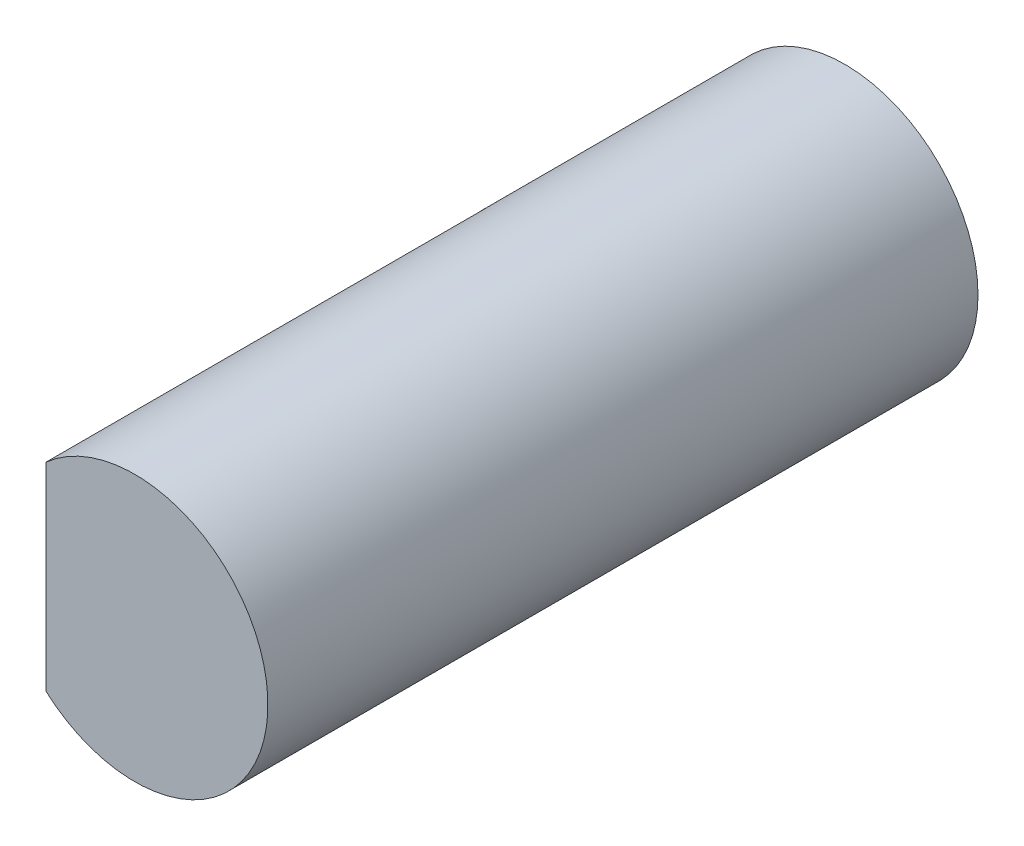
ISO-10303-21;
HEADER;
FILE_DESCRIPTION(('STEP AP214'),'2;1');
FILE_NAME('part.step','',(''),(''),'','','');
FILE_SCHEMA(('AUTOMOTIVE_DESIGN { 1 0 10303 214 1 1 1 1 }'));
ENDSEC;
DATA;
#1=APPLICATION_CONTEXT('core data for automotive mechanical design processes');
#2=APPLICATION_PROTOCOL_DEFINITION('international standard','automotive_design',2000,#1);
#3=PRODUCT_CONTEXT('',#1,'mechanical');
#4=PRODUCT('Part','Part','',(#3));
#5=PRODUCT_RELATED_PRODUCT_CATEGORY('part','',(#4));
#6=PRODUCT_DEFINITION_FORMATION('','',#4);
#7=PRODUCT_DEFINITION_CONTEXT('part definition',#1,'design');
#8=PRODUCT_DEFINITION('design','',#6,#7);
#9=PRODUCT_DEFINITION_SHAPE('','',#8);
#10=(LENGTH_UNIT() NAMED_UNIT(*) SI_UNIT(.MILLI.,.METRE.));
#11=(NAMED_UNIT(*) PLANE_ANGLE_UNIT() SI_UNIT($,.RADIAN.));
#12=(NAMED_UNIT(*) SI_UNIT($,.STERADIAN.) SOLID_ANGLE_UNIT());
#13=UNCERTAINTY_MEASURE_WITH_UNIT(LENGTH_MEASURE(1.E-05),#10,'distance_accuracy_value','');
#14=(GEOMETRIC_REPRESENTATION_CONTEXT(3) GLOBAL_UNCERTAINTY_ASSIGNED_CONTEXT((#13)) GLOBAL_UNIT_ASSIGNED_CONTEXT((#10,
#11,#12)) REPRESENTATION_CONTEXT('',''));
#15=CARTESIAN_POINT('',(0.,0.,0.));
#16=DIRECTION('',(0.,0.,1.));
#17=DIRECTION('',(1.,0.,0.));
#18=AXIS2_PLACEMENT_3D('',#15,#16,#17);
#19=CARTESIAN_POINT('',(0.,0.,8.));
#20=DIRECTION('',(0.,0.,-1.));
#21=DIRECTION('',(-1.,0.,0.));
#22=AXIS2_PLACEMENT_3D('',#19,#20,#21);
#23=CYLINDRICAL_SURFACE('',#22,1.5);
#24=CARTESIAN_POINT('',(0.,0.,8.));
#25=DIRECTION('',(0.,0.,1.));
#26=DIRECTION('',(1.,0.,0.));
#27=AXIS2_PLACEMENT_3D('',#24,#25,#26);
#28=CIRCLE('',#27,1.5);
#29=CARTESIAN_POINT('',(-1.,-1.1180339887499,8.));
#30=VERTEX_POINT('',#29);
#31=CARTESIAN_POINT('',(-1.,1.1180339887499,8.));
#32=VERTEX_POINT('',#31);
#33=EDGE_CURVE('E73',#30,#32,#28,.T.);
#34=ORIENTED_EDGE('',*,*,#33,.F.);
#35=DIRECTION('',(0.,0.,-1.));
#36=VECTOR('',#35,1.);
#37=CARTESIAN_POINT('',(-1.,-1.1180339887499,8.));
#38=LINE('',#37,#36);
#39=CARTESIAN_POINT('',(-1.,-1.1180339887499,3.));
#40=VERTEX_POINT('',#39);
#41=EDGE_CURVE('E58',#30,#40,#38,.T.);
#42=ORIENTED_EDGE('',*,*,#41,.T.);
#43=CARTESIAN_POINT('',(0.,0.,3.));
#44=DIRECTION('',(0.,0.,1.));
#45=DIRECTION('',(1.,0.,0.));
#46=AXIS2_PLACEMENT_3D('',#43,#44,#45);
#47=CIRCLE('',#46,1.5);
#48=CARTESIAN_POINT('',(-1.,1.1180339887499,3.));
#49=VERTEX_POINT('',#48);
#50=EDGE_CURVE('E11',#49,#40,#47,.T.);
#51=ORIENTED_EDGE('',*,*,#50,.F.);
#52=DIRECTION('',(0.,0.,-1.));
#53=VECTOR('',#52,1.);
#54=CARTESIAN_POINT('',(-1.,1.1180339887499,8.));
#55=LINE('',#54,#53);
#56=EDGE_CURVE('E63',#49,#32,#55,.F.);
#57=ORIENTED_EDGE('',*,*,#56,.T.);
#58=EDGE_LOOP('',(#34,#42,#51,#57));
#59=FACE_BOUND('',#58,.T.);
#60=CARTESIAN_POINT('',(0.,0.,0.));
#61=DIRECTION('',(0.,0.,1.));
#62=DIRECTION('',(1.,0.,0.));
#63=AXIS2_PLACEMENT_3D('',#60,#61,#62);
#64=CIRCLE('',#63,1.5);
#65=CARTESIAN_POINT('',(1.5,0.,0.));
#66=VERTEX_POINT('',#65);
#67=EDGE_CURVE('E82',#66,#66,#64,.T.);
#68=ORIENTED_EDGE('',*,*,#67,.T.);
#69=EDGE_LOOP('',(#68));
#70=FACE_BOUND('',#69,.T.);
#71=ADVANCED_FACE('F43',(#59,#70),#23,.T.);
#72=CARTESIAN_POINT('',(0.,0.,8.));
#73=DIRECTION('',(0.,0.,1.));
#74=DIRECTION('',(1.,0.,0.));
#75=AXIS2_PLACEMENT_3D('',#72,#73,#74);
#76=PLANE('',#75);
#77=DIRECTION('',(0.,1.,0.));
#78=VECTOR('',#77,1.);
#79=CARTESIAN_POINT('',(-1.,0.,8.));
#80=LINE('',#79,#78);
#81=EDGE_CURVE('E51',#30,#32,#80,.T.);
#82=ORIENTED_EDGE('',*,*,#81,.F.);
#83=ORIENTED_EDGE('',*,*,#33,.T.);
#84=EDGE_LOOP('',(#82,#83));
#85=FACE_BOUND('',#84,.T.);
#86=ADVANCED_FACE('F80',(#85),#76,.T.);
#87=CARTESIAN_POINT('',(0.,0.,0.));
#88=DIRECTION('',(0.,0.,1.));
#89=DIRECTION('',(1.,0.,0.));
#90=AXIS2_PLACEMENT_3D('',#87,#88,#89);
#91=PLANE('',#90);
#92=ORIENTED_EDGE('',*,*,#67,.F.);
#93=EDGE_LOOP('',(#92));
#94=FACE_BOUND('',#93,.T.);
#95=ADVANCED_FACE('F94',(#94),#91,.F.);
#96=CARTESIAN_POINT('',(0.,0.,3.));
#97=DIRECTION('',(0.,0.,1.));
#98=DIRECTION('',(1.,0.,0.));
#99=AXIS2_PLACEMENT_3D('',#96,#97,#98);
#100=PLANE('',#99);
#101=ORIENTED_EDGE('',*,*,#50,.T.);
#102=DIRECTION('',(0.,1.,0.));
#103=VECTOR('',#102,1.);
#104=CARTESIAN_POINT('',(-1.,1.5,3.));
#105=LINE('',#104,#103);
#106=EDGE_CURVE('E78',#40,#49,#105,.T.);
#107=ORIENTED_EDGE('',*,*,#106,.T.);
#108=EDGE_LOOP('',(#101,#107));
#109=FACE_BOUND('',#108,.T.);
#110=ADVANCED_FACE('F92',(#109),#100,.T.);
#111=CARTESIAN_POINT('',(-1.,1.5,3.));
#112=DIRECTION('',(1.,0.,0.));
#113=DIRECTION('',(0.,1.,0.));
#114=AXIS2_PLACEMENT_3D('',#111,#112,#113);
#115=PLANE('',#114);
#116=ORIENTED_EDGE('',*,*,#81,.T.);
#117=ORIENTED_EDGE('',*,*,#56,.F.);
#118=ORIENTED_EDGE('',*,*,#106,.F.);
#119=ORIENTED_EDGE('',*,*,#41,.F.);
#120=EDGE_LOOP('',(#116,#117,#118,#119));
#121=FACE_BOUND('',#120,.T.);
#122=ADVANCED_FACE('F68',(#121),#115,.F.);
#123=CLOSED_SHELL('',(#71,#86,#95,#110,#122));
#124=MANIFOLD_SOLID_BREP('B2',#123);
#125=ADVANCED_BREP_SHAPE_REPRESENTATION('',(#18,#124),#14);
#126=SHAPE_DEFINITION_REPRESENTATION(#9,#125);
ENDSEC;
END-ISO-10303-21;
